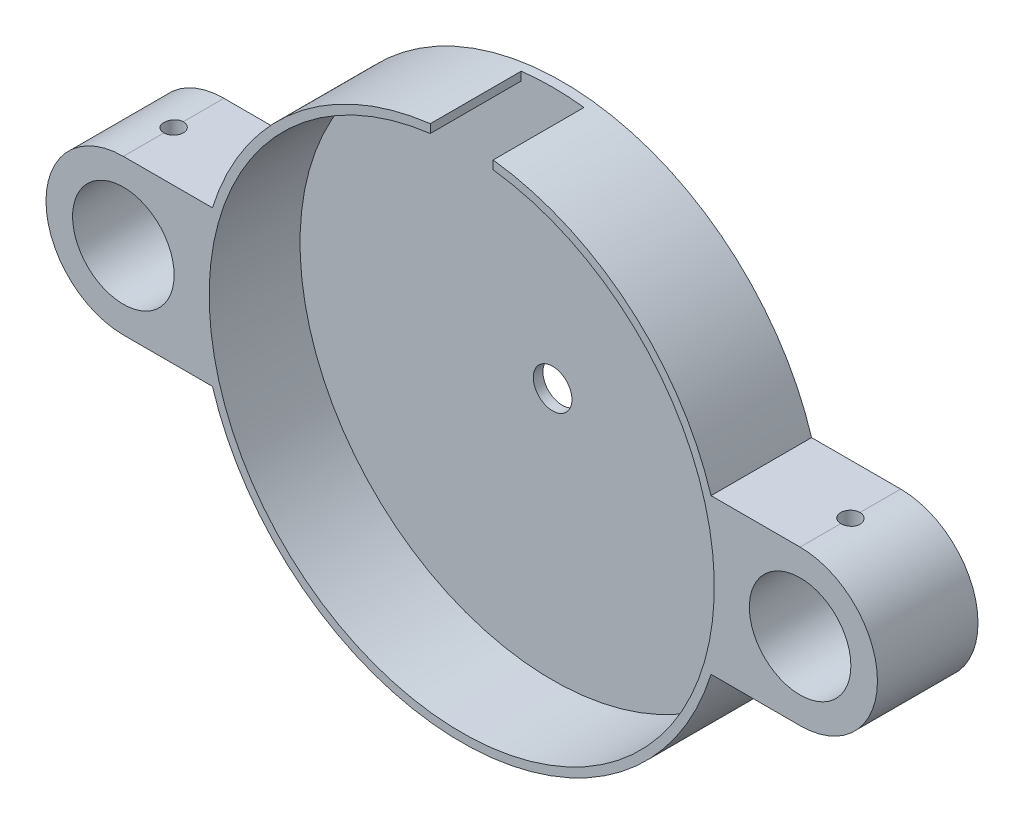
ISO-10303-21;
HEADER;
FILE_DESCRIPTION(('STEP AP214'),'2;1');
FILE_NAME('part.step','',(''),(''),'','','');
FILE_SCHEMA(('AUTOMOTIVE_DESIGN { 1 0 10303 214 1 1 1 1 }'));
ENDSEC;
DATA;
#1=APPLICATION_CONTEXT('core data for automotive mechanical design processes');
#2=APPLICATION_PROTOCOL_DEFINITION('international standard','automotive_design',2000,#1);
#3=PRODUCT_CONTEXT('',#1,'mechanical');
#4=PRODUCT('Part','Part','',(#3));
#5=PRODUCT_RELATED_PRODUCT_CATEGORY('part','',(#4));
#6=PRODUCT_DEFINITION_FORMATION('','',#4);
#7=PRODUCT_DEFINITION_CONTEXT('part definition',#1,'design');
#8=PRODUCT_DEFINITION('design','',#6,#7);
#9=PRODUCT_DEFINITION_SHAPE('','',#8);
#10=(LENGTH_UNIT() NAMED_UNIT(*) SI_UNIT(.MILLI.,.METRE.));
#11=(NAMED_UNIT(*) PLANE_ANGLE_UNIT() SI_UNIT($,.RADIAN.));
#12=(NAMED_UNIT(*) SI_UNIT($,.STERADIAN.) SOLID_ANGLE_UNIT());
#13=UNCERTAINTY_MEASURE_WITH_UNIT(LENGTH_MEASURE(1.E-05),#10,'distance_accuracy_value','');
#14=(GEOMETRIC_REPRESENTATION_CONTEXT(3) GLOBAL_UNCERTAINTY_ASSIGNED_CONTEXT((#13)) GLOBAL_UNIT_ASSIGNED_CONTEXT((#10,
#11,#12)) REPRESENTATION_CONTEXT('',''));
#15=CARTESIAN_POINT('',(0.,0.,0.));
#16=DIRECTION('',(0.,0.,1.));
#17=DIRECTION('',(1.,0.,0.));
#18=AXIS2_PLACEMENT_3D('',#15,#16,#17);
#19=CARTESIAN_POINT('',(-70.,0.,67.8007201300086));
#20=DIRECTION('',(0.,0.,-1.));
#21=DIRECTION('',(-1.,0.,0.));
#22=AXIS2_PLACEMENT_3D('',#19,#20,#21);
#23=CYLINDRICAL_SURFACE('',#22,16.);
#24=CARTESIAN_POINT('',(-70.,16.,8.4));
#25=CARTESIAN_POINT('',(-70.1118728764446,15.9999984391714,8.40000475274858));
#26=CARTESIAN_POINT('',(-70.2238156594422,15.9988142764392,8.40941830333543));
#27=CARTESIAN_POINT('',(-70.4445862416718,15.9942043208909,8.44682220365664));
#28=CARTESIAN_POINT('',(-70.553410664499,15.9907761875314,8.47483195033871));
#29=CARTESIAN_POINT('',(-70.7647164598504,15.9820644883553,8.54859011513127));
#30=CARTESIAN_POINT('',(-70.8672020481169,15.9767821716443,8.59432659344788));
#31=CARTESIAN_POINT('',(-71.0630235799144,15.9649496070248,8.70221382717583));
#32=CARTESIAN_POINT('',(-71.1563610892451,15.9583995766729,8.76436176682457));
#33=CARTESIAN_POINT('',(-71.3317702535451,15.9447225704506,8.90367355987167));
#34=CARTESIAN_POINT('',(-71.4137842919497,15.9375929175393,8.98090970347699));
#35=CARTESIAN_POINT('',(-71.563722234846,15.923581808078,9.14805025882931));
#36=CARTESIAN_POINT('',(-71.6316454211138,15.9167003641942,9.2379553159306));
#37=CARTESIAN_POINT('',(-71.7516881290271,15.9039384449567,9.42825598205253));
#38=CARTESIAN_POINT('',(-71.8037536767529,15.8980614174233,9.52868588925435));
#39=CARTESIAN_POINT('',(-71.8902584612601,15.8880090276615,9.73694964155788));
#40=CARTESIAN_POINT('',(-71.9246983664522,15.8838336009051,9.8447832057176));
#41=CARTESIAN_POINT('',(-71.9747991840198,15.8776827168289,10.0641953564694));
#42=CARTESIAN_POINT('',(-71.9905573717854,15.875695867494,10.1757514061633));
#43=CARTESIAN_POINT('',(-72.0031484396458,15.8741122251423,10.3999410107775));
#44=CARTESIAN_POINT('',(-71.9999820808019,15.8745153360121,10.512574522185));
#45=CARTESIAN_POINT('',(-71.9748937891583,15.877655642958,10.735043861799));
#46=CARTESIAN_POINT('',(-71.9530790103878,15.8803795036826,10.8448919889602));
#47=CARTESIAN_POINT('',(-71.8914803065456,15.887833598061,11.0593560169752));
#48=CARTESIAN_POINT('',(-71.8516960174015,15.8925638723658,11.1639718117712));
#49=CARTESIAN_POINT('',(-71.7551724479293,15.9035129269172,11.3653343992173));
#50=CARTESIAN_POINT('',(-71.6983866029661,15.9097357856916,11.4620586401992));
#51=CARTESIAN_POINT('',(-71.5695051755655,15.9229656914448,11.6446453555306));
#52=CARTESIAN_POINT('',(-71.4974088928646,15.9299727742853,11.7305073327789));
#53=CARTESIAN_POINT('',(-71.339359288603,15.9440408791234,11.8895541685782));
#54=CARTESIAN_POINT('',(-71.253313606272,15.9511019390951,11.9626472734128));
#55=CARTESIAN_POINT('',(-71.0701257352911,15.9644370604468,12.0933671040244));
#56=CARTESIAN_POINT('',(-70.9729835210546,15.970711120012,12.1509937941376));
#57=CARTESIAN_POINT('',(-70.7702893370908,15.9817692177486,12.2491450563711));
#58=CARTESIAN_POINT('',(-70.6647345562702,15.9865527552123,12.289663883105));
#59=CARTESIAN_POINT('',(-70.4482463523449,15.9940862862405,12.3523763948186));
#60=CARTESIAN_POINT('',(-70.3373131813046,15.996836375007,12.3745709377096));
#61=CARTESIAN_POINT('',(-70.1140105311308,15.9999807712861,12.3998859394084));
#62=CARTESIAN_POINT('',(-70.0016555921589,16.0003906891411,12.4031327938913));
#63=CARTESIAN_POINT('',(-69.778003170802,15.9988507040434,12.3907938127552));
#64=CARTESIAN_POINT('',(-69.6667056659483,15.9969008513457,12.3752083781987));
#65=CARTESIAN_POINT('',(-69.4487003938228,15.9908701500535,12.3257522329805));
#66=CARTESIAN_POINT('',(-69.3419787436603,15.986796326511,12.2919417892779));
#67=CARTESIAN_POINT('',(-69.1357202761133,15.9769737848016,12.2070580384697));
#68=CARTESIAN_POINT('',(-69.0361837028278,15.971225009765,12.1559841452069));
#69=CARTESIAN_POINT('',(-68.8465563834501,15.9586545832809,12.037717489994));
#70=CARTESIAN_POINT('',(-68.756516992045,15.9518275523401,11.9704429681555));
#71=CARTESIAN_POINT('',(-68.588962408299,15.9378811386053,11.8218004019726));
#72=CARTESIAN_POINT('',(-68.5114477133305,15.9307617442152,11.7404317981992));
#73=CARTESIAN_POINT('',(-68.3706944329456,15.9169848437007,11.5653540665943));
#74=CARTESIAN_POINT('',(-68.3075396315457,15.9103301977706,11.4715773229517));
#75=CARTESIAN_POINT('',(-68.1978776884452,15.8982832882972,11.2746734041162));
#76=CARTESIAN_POINT('',(-68.1513702130173,15.8928909994482,11.1715464164188));
#77=CARTESIAN_POINT('',(-68.0764587369068,15.883998803144,10.9591397446819));
#78=CARTESIAN_POINT('',(-68.0480074980343,15.8804939614783,10.8498769359616));
#79=CARTESIAN_POINT('',(-68.0098640049057,15.8757593272596,10.6280780129755));
#80=CARTESIAN_POINT('',(-68.0001708779714,15.8745294288702,10.5155420512328));
#81=CARTESIAN_POINT('',(-67.9998347711321,15.8744870158596,10.2912248566363));
#82=CARTESIAN_POINT('',(-68.0090601618406,15.8756577980156,10.1794438013345));
#83=CARTESIAN_POINT('',(-68.0460204761205,15.8802489162976,9.95903429652395));
#84=CARTESIAN_POINT('',(-68.0737554016754,15.8836692526647,9.85040584735297));
#85=CARTESIAN_POINT('',(-68.1469063410483,15.8923689261964,9.63940243458689));
#86=CARTESIAN_POINT('',(-68.1923160152233,15.8976475967423,9.53702524398256));
#87=CARTESIAN_POINT('',(-68.2995144782798,15.9094702659586,9.34132267676137));
#88=CARTESIAN_POINT('',(-68.3613034723923,15.9160142804833,9.24799741358415));
#89=CARTESIAN_POINT('',(-68.4999949349873,15.9296848380179,9.07237501972763));
#90=CARTESIAN_POINT('',(-68.57699549938,15.9368149766723,8.99015563123603));
#91=CARTESIAN_POINT('',(-68.7437198184253,15.9508226527432,8.83975453986563));
#92=CARTESIAN_POINT('',(-68.8334465686867,15.9577001302047,8.77157615138056));
#93=CARTESIAN_POINT('',(-69.0234675033166,15.970456452694,8.65097171431577));
#94=CARTESIAN_POINT('',(-69.1238005763231,15.9763314006264,8.5986065552806));
#95=CARTESIAN_POINT('',(-69.331853678159,15.9863811926138,8.51154300566698));
#96=CARTESIAN_POINT('',(-69.4395655353038,15.9905578829566,8.47682541891724));
#97=CARTESIAN_POINT('',(-69.6231953824257,15.995733762622,8.43435252946296));
#98=CARTESIAN_POINT('',(-69.6979554691865,15.9973258071636,8.42148884641435));
#99=CARTESIAN_POINT('',(-69.8484663494301,15.9994594506335,8.40431100344542));
#100=CARTESIAN_POINT('',(-69.9242171356032,16.0000010573078,8.39999678048056));
#101=CARTESIAN_POINT('',(-70.,16.,8.4));
#102=B_SPLINE_CURVE_WITH_KNOTS('',3,(#24,#25,#26,#27,#28,#29,#30,#31,#32,#33,#34,#35,#36,#37,
#38,#39,#40,#41,#42,#43,#44,#45,#46,#47,#48,#49,#50,#51,#52,#53,#54,#55,#56,#57,#58,#59,#60,#61,
#62,#63,#64,#65,#66,#67,#68,#69,#70,#71,#72,#73,#74,#75,#76,#77,#78,#79,#80,#81,#82,#83,#84,#85,
#86,#87,#88,#89,#90,#91,#92,#93,#94,#95,#96,#97,#98,#99,#100,#101),.UNSPECIFIED.,.T.,.F.,(4,2,2,
2,2,2,2,2,2,2,2,2,2,2,2,2,2,2,2,2,2,2,2,2,2,2,2,2,2,2,2,2,2,2,2,2,2,2,4),(0.,0.335341818221008,
0.671033968754733,1.0065004065454,1.34190932472859,1.67896650561473,2.01604086240007,
2.35425000255094,2.69244631597444,3.02887380229055,3.36528775907729,3.69978157153352,
4.03428216132992,4.36970741028426,4.7051480041091,5.04290782509133,5.38066842490488,
5.71854236585281,6.05640048723023,6.39200223513535,6.7275968360154,7.06208843114714,
7.39659138463156,7.73281922342735,8.06906041100067,8.40721577206055,8.74536435377228,
9.08262459424737,9.41986914408496,9.75477520961769,10.0896813110364,10.4244673976519,
10.7592576792981,11.0962819015346,11.4333855877601,11.7717712242948,12.1097879894722,
12.336950745501,12.5641118264035),.UNSPECIFIED.);
#103=CARTESIAN_POINT('',(-70.,16.,8.4));
#104=VERTEX_POINT('',#103);
#105=CARTESIAN_POINT('',(-70.,16.,12.4));
#106=VERTEX_POINT('',#105);
#107=EDGE_CURVE('E55',#104,#106,#102,.T.);
#108=ORIENTED_EDGE('',*,*,#107,.F.);
#109=DIRECTION('',(0.,0.,-1.));
#110=VECTOR('',#109,1.);
#111=CARTESIAN_POINT('',(-70.,16.,67.8007201300086));
#112=LINE('',#111,#110);
#113=CARTESIAN_POINT('',(-70.,16.,0.));
#114=VERTEX_POINT('',#113);
#115=EDGE_CURVE('E192',#104,#114,#112,.T.);
#116=ORIENTED_EDGE('',*,*,#115,.T.);
#117=CARTESIAN_POINT('',(-70.,0.,0.));
#118=DIRECTION('',(0.,0.,1.));
#119=DIRECTION('',(1.,0.,0.));
#120=AXIS2_PLACEMENT_3D('',#117,#118,#119);
#121=CIRCLE('',#120,16.);
#122=CARTESIAN_POINT('',(-70.,-16.,0.));
#123=VERTEX_POINT('',#122);
#124=EDGE_CURVE('E178',#114,#123,#121,.T.);
#125=ORIENTED_EDGE('',*,*,#124,.T.);
#126=DIRECTION('',(0.,0.,-1.));
#127=VECTOR('',#126,1.);
#128=CARTESIAN_POINT('',(-70.,-16.,67.8007201300086));
#129=LINE('',#128,#127);
#130=CARTESIAN_POINT('',(-70.,-16.,20.8));
#131=VERTEX_POINT('',#130);
#132=EDGE_CURVE('E190',#131,#123,#129,.T.);
#133=ORIENTED_EDGE('',*,*,#132,.F.);
#134=CARTESIAN_POINT('',(-70.,0.,20.8));
#135=DIRECTION('',(0.,0.,1.));
#136=DIRECTION('',(1.,0.,0.));
#137=AXIS2_PLACEMENT_3D('',#134,#135,#136);
#138=CIRCLE('',#137,16.);
#139=CARTESIAN_POINT('',(-70.,16.,20.8));
#140=VERTEX_POINT('',#139);
#141=EDGE_CURVE('E168',#140,#131,#138,.T.);
#142=ORIENTED_EDGE('',*,*,#141,.F.);
#143=EDGE_CURVE('E193',#140,#106,#112,.T.);
#144=ORIENTED_EDGE('',*,*,#143,.T.);
#145=EDGE_LOOP('',(#108,#116,#125,#133,#142,#144));
#146=FACE_BOUND('',#145,.T.);
#147=ADVANCED_FACE('F35',(#146),#23,.T.);
#148=CARTESIAN_POINT('',(-70.,0.,67.8007201300086));
#149=DIRECTION('',(0.,0.,-1.));
#150=DIRECTION('',(-1.,0.,0.));
#151=AXIS2_PLACEMENT_3D('',#148,#149,#150);
#152=CYLINDRICAL_SURFACE('',#151,10.5);
#153=CARTESIAN_POINT('',(-70.,0.,20.8));
#154=DIRECTION('',(0.,0.,1.));
#155=DIRECTION('',(1.,0.,0.));
#156=AXIS2_PLACEMENT_3D('',#153,#154,#155);
#157=CIRCLE('',#156,10.5);
#158=CARTESIAN_POINT('',(-59.5,0.,20.8));
#159=VERTEX_POINT('',#158);
#160=EDGE_CURVE('E169',#159,#159,#157,.T.);
#161=ORIENTED_EDGE('',*,*,#160,.T.);
#162=EDGE_LOOP('',(#161));
#163=FACE_BOUND('',#162,.T.);
#164=CARTESIAN_POINT('',(-70.,0.,0.));
#165=DIRECTION('',(0.,0.,1.));
#166=DIRECTION('',(1.,0.,0.));
#167=AXIS2_PLACEMENT_3D('',#164,#165,#166);
#168=CIRCLE('',#167,10.5);
#169=CARTESIAN_POINT('',(-59.5,0.,0.));
#170=VERTEX_POINT('',#169);
#171=EDGE_CURVE('E184',#170,#170,#168,.T.);
#172=ORIENTED_EDGE('',*,*,#171,.F.);
#173=EDGE_LOOP('',(#172));
#174=FACE_BOUND('',#173,.T.);
#175=CARTESIAN_POINT('',(-70.,10.5,8.4));
#176=CARTESIAN_POINT('',(-70.1112626732068,10.4999979743929,8.40000421621363));
#177=CARTESIAN_POINT('',(-70.2225798350984,10.4982132825978,8.40931591028934));
#178=CARTESIAN_POINT('',(-70.4420750658481,10.4912658417577,8.44629137476167));
#179=CARTESIAN_POINT('',(-70.5502504432403,10.4861002806795,8.47397042244415));
#180=CARTESIAN_POINT('',(-70.7602561823287,10.4729686963989,8.54680050282468));
#181=CARTESIAN_POINT('',(-70.8620922564569,10.4650052387144,8.59193553315135));
#182=CARTESIAN_POINT('',(-71.0567374462999,10.4471465532496,8.69835043699249));
#183=CARTESIAN_POINT('',(-71.1495472467971,10.4372514721844,8.75962908445376));
#184=CARTESIAN_POINT('',(-71.3246595476384,10.4164844504796,8.89739426578835));
#185=CARTESIAN_POINT('',(-71.4068345602883,10.4056029207544,8.97404141937447));
#186=CARTESIAN_POINT('',(-71.5572415094345,10.3841602588096,9.14002242109597));
#187=CARTESIAN_POINT('',(-71.6254724245306,10.3735991501089,9.2293571977834));
#188=CARTESIAN_POINT('',(-71.7465874919159,10.3538997919733,9.41908226920558));
#189=CARTESIAN_POINT('',(-71.7993414175367,10.3447739002785,9.51955709310997));
#190=CARTESIAN_POINT('',(-71.8871712132609,10.3291136064192,9.72814634260273));
#191=CARTESIAN_POINT('',(-71.92224865908,10.3225789732761,9.83626008626301));
#192=CARTESIAN_POINT('',(-71.9733195203297,10.3129377029114,10.0556923427791));
#193=CARTESIAN_POINT('',(-71.9895355846456,10.3097911053349,10.1669572453517));
#194=CARTESIAN_POINT('',(-72.0031145696447,10.307161743861,10.3906696004605));
#195=CARTESIAN_POINT('',(-72.0004792358439,10.307678640748,10.5031169425477));
#196=CARTESIAN_POINT('',(-71.9766106493159,10.3122815009876,10.7243854627453));
#197=CARTESIAN_POINT('',(-71.955631051433,10.3163187841917,10.8332351655737));
#198=CARTESIAN_POINT('',(-71.8960691517838,10.3274310100144,11.0458410804289));
#199=CARTESIAN_POINT('',(-71.8574860803629,10.3345060854497,11.14959706953));
#200=CARTESIAN_POINT('',(-71.7635657672444,10.3509473410172,11.3498098840211));
#201=CARTESIAN_POINT('',(-71.7081265419373,10.3603273986465,11.4462176819518));
#202=CARTESIAN_POINT('',(-71.5821397235649,10.3803126085096,11.6284576581049));
#203=CARTESIAN_POINT('',(-71.5115905497996,10.3909178888643,11.714288728381));
#204=CARTESIAN_POINT('',(-71.3560210788072,10.4123704255534,11.8744039305281));
#205=CARTESIAN_POINT('',(-71.2707839303096,10.4232188107929,11.9484773772791));
#206=CARTESIAN_POINT('',(-71.0889825398817,10.4437767134731,12.0813062387182));
#207=CARTESIAN_POINT('',(-70.9924181773961,10.4534862187906,12.1400614903535));
#208=CARTESIAN_POINT('',(-70.7904803819306,10.4706929218926,12.2406189958384));
#209=CARTESIAN_POINT('',(-70.6850955207478,10.4781871907582,12.2823988323844));
#210=CARTESIAN_POINT('',(-70.4686287401209,10.4900964856593,12.3476038217401));
#211=CARTESIAN_POINT('',(-70.3575474469878,10.4945118494381,12.3710309877975));
#212=CARTESIAN_POINT('',(-70.1346531021664,10.4997193000827,12.3985712036361));
#213=CARTESIAN_POINT('',(-70.022876932053,10.5005655209332,12.4029728435002));
#214=CARTESIAN_POINT('',(-69.800185889193,10.498689066668,12.3931118947015));
#215=CARTESIAN_POINT('',(-69.6892709730054,10.4959665727471,12.3788502536322));
#216=CARTESIAN_POINT('',(-69.4723699119281,10.487292340486,12.3323074736684));
#217=CARTESIAN_POINT('',(-69.3663511881794,10.481366867614,12.3001728379361));
#218=CARTESIAN_POINT('',(-69.1612062863362,10.4669484110117,12.2189551525294));
#219=CARTESIAN_POINT('',(-69.0620805883639,10.4584552486531,12.1698709236771));
#220=CARTESIAN_POINT('',(-68.8723072987732,10.4397084980025,12.0555119948254));
#221=CARTESIAN_POINT('',(-68.7817674937305,10.4294362000209,11.9900615582954));
#222=CARTESIAN_POINT('',(-68.6128525406399,10.4083178834007,11.8450653311663));
#223=CARTESIAN_POINT('',(-68.5344785687825,10.3974718094254,11.7655181792897));
#224=CARTESIAN_POINT('',(-68.3910194223251,10.376248096682,11.5932783505025));
#225=CARTESIAN_POINT('',(-68.3261314712031,10.3658789338459,11.500420185608));
#226=CARTESIAN_POINT('',(-68.2128743549366,10.3469557185905,11.3049524302999));
#227=CARTESIAN_POINT('',(-68.164504564079,10.3384015974216,11.2023432094476));
#228=CARTESIAN_POINT('',(-68.0859340266442,10.3241439661812,10.9907790279234));
#229=CARTESIAN_POINT('',(-68.0556440655268,10.3184264827985,10.8818581855824));
#230=CARTESIAN_POINT('',(-68.0138188877937,10.3104580861843,10.6603537285239));
#231=CARTESIAN_POINT('',(-68.0022814794188,10.3082067678363,10.5477705434226));
#232=CARTESIAN_POINT('',(-67.9983640721639,10.3074466067947,10.3241138107673));
#233=CARTESIAN_POINT('',(-68.0056728504749,10.3088769648064,10.2130458023238));
#234=CARTESIAN_POINT('',(-68.0385576936863,10.3151839360293,9.99375270386313));
#235=CARTESIAN_POINT('',(-68.0641336410553,10.3200605270675,9.88552759555926));
#236=CARTESIAN_POINT('',(-68.1326937314155,10.3326845207864,9.67516695144504));
#237=CARTESIAN_POINT('',(-68.1756431324414,10.3404261915088,9.57301972649356));
#238=CARTESIAN_POINT('',(-68.2776965366131,10.357911918352,9.37733152380696));
#239=CARTESIAN_POINT('',(-68.3368017312942,10.367656122152,9.28379118153405));
#240=CARTESIAN_POINT('',(-68.4705665135245,10.3882370930006,9.10641518234009));
#241=CARTESIAN_POINT('',(-68.545452199097,10.3990884079132,9.02275169132));
#242=CARTESIAN_POINT('',(-68.70818183305,10.4205531347344,8.86907465998553));
#243=CARTESIAN_POINT('',(-68.7960287538822,10.4311664914262,8.79906425936234));
#244=CARTESIAN_POINT('',(-68.9831706223824,10.4510758496987,8.67406848713434));
#245=CARTESIAN_POINT('',(-69.0825647999533,10.4603586261554,8.61922950459286));
#246=CARTESIAN_POINT('',(-69.2893021123409,10.4764315464421,8.52711716159649));
#247=CARTESIAN_POINT('',(-69.3966377424916,10.4832240083557,8.4898274563583));
#248=CARTESIAN_POINT('',(-69.5868933144151,10.49218127144,8.44136262715925));
#249=CARTESIAN_POINT('',(-69.6687075564226,10.4950965973909,8.425878415039));
#250=CARTESIAN_POINT('',(-69.8336710716053,10.4990066930654,8.40519566348294));
#251=CARTESIAN_POINT('',(-69.9168203088865,10.5000015143387,8.39999684796943));
#252=CARTESIAN_POINT('',(-70.,10.5,8.4));
#253=B_SPLINE_CURVE_WITH_KNOTS('',3,(#175,#176,#177,#178,#179,#180,#181,#182,#183,#184,#185,
#186,#187,#188,#189,#190,#191,#192,#193,#194,#195,#196,#197,#198,#199,#200,#201,#202,#203,#204,
#205,#206,#207,#208,#209,#210,#211,#212,#213,#214,#215,#216,#217,#218,#219,#220,#221,#222,#223,
#224,#225,#226,#227,#228,#229,#230,#231,#232,#233,#234,#235,#236,#237,#238,#239,#240,#241,#242,
#243,#244,#245,#246,#247,#248,#249,#250,#251,#252),.UNSPECIFIED.,.T.,.F.,(4,2,2,2,2,2,2,2,2,2,2,
2,2,2,2,2,2,2,2,2,2,2,2,2,2,2,2,2,2,2,2,2,2,2,2,2,2,2,4),(0.,0.333483802430031,
0.667245332623754,1.00070161708276,1.33413258396014,1.67124928303734,2.0083906669481,
2.34829242006152,2.68816386831249,3.02398123137649,3.3597675003563,3.69098283657374,
4.02221265549115,4.35548777386576,4.68879777425771,5.02753295594229,5.36627174310671,
5.70545641749535,6.04460387885446,6.37858849301336,6.71255615038157,7.04382581519729,
7.37511853098563,7.71013402869824,8.04518189550172,8.38482983470164,8.72446490650361,
9.06240989581901,9.40031538398817,9.73267662393087,10.0650357254753,10.3967334632936,
10.728455671356,11.065300358868,11.4022224167316,11.7422902517103,12.082040729505,
12.3313590630718,12.5806707044156),.UNSPECIFIED.);
#254=CARTESIAN_POINT('',(-70.,10.5,8.4));
#255=VERTEX_POINT('',#254);
#256=EDGE_CURVE('E39',#255,#255,#253,.T.);
#257=ORIENTED_EDGE('',*,*,#256,.T.);
#258=EDGE_LOOP('',(#257));
#259=FACE_BOUND('',#258,.T.);
#260=ADVANCED_FACE('F249',(#163,#174,#259),#152,.F.);
#261=CARTESIAN_POINT('',(70.,0.,67.8007201300086));
#262=DIRECTION('',(0.,0.,-1.));
#263=DIRECTION('',(-1.,0.,0.));
#264=AXIS2_PLACEMENT_3D('',#261,#262,#263);
#265=CYLINDRICAL_SURFACE('',#264,10.5);
#266=CARTESIAN_POINT('',(70.,0.,20.8));
#267=DIRECTION('',(0.,0.,1.));
#268=DIRECTION('',(1.,0.,0.));
#269=AXIS2_PLACEMENT_3D('',#266,#267,#268);
#270=CIRCLE('',#269,10.5);
#271=CARTESIAN_POINT('',(80.5,0.,20.8));
#272=VERTEX_POINT('',#271);
#273=EDGE_CURVE('E314',#272,#272,#270,.T.);
#274=ORIENTED_EDGE('',*,*,#273,.T.);
#275=EDGE_LOOP('',(#274));
#276=FACE_BOUND('',#275,.T.);
#277=CARTESIAN_POINT('',(70.,0.,0.));
#278=DIRECTION('',(0.,0.,1.));
#279=DIRECTION('',(1.,0.,0.));
#280=AXIS2_PLACEMENT_3D('',#277,#278,#279);
#281=CIRCLE('',#280,10.5);
#282=CARTESIAN_POINT('',(80.5,0.,0.));
#283=VERTEX_POINT('',#282);
#284=EDGE_CURVE('E305',#283,#283,#281,.T.);
#285=ORIENTED_EDGE('',*,*,#284,.F.);
#286=EDGE_LOOP('',(#285));
#287=FACE_BOUND('',#286,.T.);
#288=CARTESIAN_POINT('',(70.,10.5,8.4));
#289=CARTESIAN_POINT('',(69.8887373267932,10.4999979743929,8.40000421621363));
#290=CARTESIAN_POINT('',(69.7774201649016,10.4982132825978,8.40931591028934));
#291=CARTESIAN_POINT('',(69.5579249341519,10.4912658417576,8.44629137476167));
#292=CARTESIAN_POINT('',(69.4497495567597,10.4861002806795,8.47397042244415));
#293=CARTESIAN_POINT('',(69.2397438176713,10.4729686963989,8.54680050282468));
#294=CARTESIAN_POINT('',(69.1379077435431,10.4650052387144,8.59193553315135));
#295=CARTESIAN_POINT('',(68.9432625537001,10.4471465532496,8.69835043699249));
#296=CARTESIAN_POINT('',(68.8504527532029,10.4372514721844,8.75962908445376));
#297=CARTESIAN_POINT('',(68.6753404523616,10.4164844504796,8.89739426578835));
#298=CARTESIAN_POINT('',(68.5931654397117,10.4056029207544,8.97404141937447));
#299=CARTESIAN_POINT('',(68.4427584905655,10.3841602588095,9.14002242109597));
#300=CARTESIAN_POINT('',(68.3745275754694,10.3735991501089,9.2293571977834));
#301=CARTESIAN_POINT('',(68.2534125080841,10.3538997919733,9.41908226920558));
#302=CARTESIAN_POINT('',(68.2006585824633,10.3447739002785,9.51955709310997));
#303=CARTESIAN_POINT('',(68.1128287867391,10.3291136064192,9.72814634260273));
#304=CARTESIAN_POINT('',(68.07775134092,10.3225789732761,9.83626008626301));
#305=CARTESIAN_POINT('',(68.0266804796704,10.3129377029114,10.0556923427791));
#306=CARTESIAN_POINT('',(68.0104644153544,10.3097911053349,10.1669572453517));
#307=CARTESIAN_POINT('',(67.9968854303553,10.307161743861,10.3906696004605));
#308=CARTESIAN_POINT('',(67.9995207641561,10.307678640748,10.5031169425477));
#309=CARTESIAN_POINT('',(68.0233893506841,10.3122815009875,10.7243854627453));
#310=CARTESIAN_POINT('',(68.044368948567,10.3163187841917,10.8332351655737));
#311=CARTESIAN_POINT('',(68.1039308482162,10.3274310100144,11.0458410804289));
#312=CARTESIAN_POINT('',(68.1425139196371,10.3345060854497,11.14959706953));
#313=CARTESIAN_POINT('',(68.2364342327556,10.3509473410172,11.3498098840211));
#314=CARTESIAN_POINT('',(68.2918734580627,10.3603273986465,11.4462176819518));
#315=CARTESIAN_POINT('',(68.4178602764352,10.3803126085096,11.6284576581049));
#316=CARTESIAN_POINT('',(68.4884094502004,10.3909178888643,11.714288728381));
#317=CARTESIAN_POINT('',(68.6439789211928,10.4123704255534,11.8744039305281));
#318=CARTESIAN_POINT('',(68.7292160696904,10.4232188107929,11.9484773772791));
#319=CARTESIAN_POINT('',(68.9110174601183,10.4437767134731,12.0813062387182));
#320=CARTESIAN_POINT('',(69.007581822604,10.4534862187906,12.1400614903535));
#321=CARTESIAN_POINT('',(69.2095196180694,10.4706929218926,12.2406189958384));
#322=CARTESIAN_POINT('',(69.3149044792522,10.4781871907582,12.2823988323844));
#323=CARTESIAN_POINT('',(69.5313712598791,10.4900964856593,12.3476038217401));
#324=CARTESIAN_POINT('',(69.6424525530122,10.4945118494381,12.3710309877975));
#325=CARTESIAN_POINT('',(69.8653468978336,10.4997193000827,12.3985712036361));
#326=CARTESIAN_POINT('',(69.977123067947,10.5005655209332,12.4029728435002));
#327=CARTESIAN_POINT('',(70.1998141108071,10.498689066668,12.3931118947015));
#328=CARTESIAN_POINT('',(70.3107290269946,10.4959665727471,12.3788502536322));
#329=CARTESIAN_POINT('',(70.5276300880719,10.487292340486,12.3323074736684));
#330=CARTESIAN_POINT('',(70.6336488118207,10.481366867614,12.3001728379361));
#331=CARTESIAN_POINT('',(70.8387937136638,10.4669484110117,12.2189551525294));
#332=CARTESIAN_POINT('',(70.9379194116361,10.4584552486531,12.1698709236771));
#333=CARTESIAN_POINT('',(71.1276927012268,10.4397084980025,12.0555119948254));
#334=CARTESIAN_POINT('',(71.2182325062695,10.4294362000208,11.9900615582954));
#335=CARTESIAN_POINT('',(71.3871474593601,10.4083178834007,11.8450653311663));
#336=CARTESIAN_POINT('',(71.4655214312175,10.3974718094254,11.7655181792897));
#337=CARTESIAN_POINT('',(71.6089805776749,10.376248096682,11.5932783505025));
#338=CARTESIAN_POINT('',(71.6738685287969,10.3658789338459,11.500420185608));
#339=CARTESIAN_POINT('',(71.7871256450635,10.3469557185905,11.3049524302999));
#340=CARTESIAN_POINT('',(71.835495435921,10.3384015974216,11.2023432094476));
#341=CARTESIAN_POINT('',(71.9140659733558,10.3241439661812,10.9907790279234));
#342=CARTESIAN_POINT('',(71.9443559344732,10.3184264827985,10.8818581855824));
#343=CARTESIAN_POINT('',(71.9861811122063,10.3104580861843,10.6603537285239));
#344=CARTESIAN_POINT('',(71.9977185205812,10.3082067678363,10.5477705434226));
#345=CARTESIAN_POINT('',(72.0016359278361,10.3074466067947,10.3241138107673));
#346=CARTESIAN_POINT('',(71.9943271495251,10.3088769648064,10.2130458023238));
#347=CARTESIAN_POINT('',(71.9614423063137,10.3151839360293,9.99375270386313));
#348=CARTESIAN_POINT('',(71.9358663589447,10.3200605270675,9.88552759555926));
#349=CARTESIAN_POINT('',(71.8673062685845,10.3326845207864,9.67516695144504));
#350=CARTESIAN_POINT('',(71.8243568675586,10.3404261915088,9.57301972649356));
#351=CARTESIAN_POINT('',(71.7223034633869,10.357911918352,9.37733152380696));
#352=CARTESIAN_POINT('',(71.6631982687058,10.367656122152,9.28379118153405));
#353=CARTESIAN_POINT('',(71.5294334864755,10.3882370930006,9.1064151823401));
#354=CARTESIAN_POINT('',(71.454547800903,10.3990884079132,9.02275169132001));
#355=CARTESIAN_POINT('',(71.29181816695,10.4205531347344,8.86907465998554));
#356=CARTESIAN_POINT('',(71.2039712461179,10.4311664914262,8.79906425936234));
#357=CARTESIAN_POINT('',(71.0168293776176,10.4510758496987,8.67406848713434));
#358=CARTESIAN_POINT('',(70.9174352000467,10.4603586261554,8.61922950459286));
#359=CARTESIAN_POINT('',(70.7106978876591,10.4764315464421,8.52711716159649));
#360=CARTESIAN_POINT('',(70.6033622575085,10.4832240083557,8.4898274563583));
#361=CARTESIAN_POINT('',(70.4131066855849,10.49218127144,8.44136262715925));
#362=CARTESIAN_POINT('',(70.3312924435774,10.4950965973909,8.425878415039));
#363=CARTESIAN_POINT('',(70.1663289283947,10.4990066930654,8.40519566348294));
#364=CARTESIAN_POINT('',(70.0831796911135,10.5000015143387,8.39999684796943));
#365=CARTESIAN_POINT('',(70.,10.5,8.4));
#366=B_SPLINE_CURVE_WITH_KNOTS('',3,(#288,#289,#290,#291,#292,#293,#294,#295,#296,#297,#298,
#299,#300,#301,#302,#303,#304,#305,#306,#307,#308,#309,#310,#311,#312,#313,#314,#315,#316,#317,
#318,#319,#320,#321,#322,#323,#324,#325,#326,#327,#328,#329,#330,#331,#332,#333,#334,#335,#336,
#337,#338,#339,#340,#341,#342,#343,#344,#345,#346,#347,#348,#349,#350,#351,#352,#353,#354,#355,
#356,#357,#358,#359,#360,#361,#362,#363,#364,#365),.UNSPECIFIED.,.T.,.F.,(4,2,2,2,2,2,2,2,2,2,2,
2,2,2,2,2,2,2,2,2,2,2,2,2,2,2,2,2,2,2,2,2,2,2,2,2,2,2,4),(0.,0.333483802430031,
0.667245332623754,1.00070161708276,1.33413258396014,1.67124928303734,2.0083906669481,
2.34829242006152,2.68816386831249,3.0239812313765,3.3597675003563,3.69098283657374,
4.02221265549115,4.35548777386576,4.68879777425771,5.02753295594227,5.36627174310671,
5.70545641749535,6.04460387885446,6.37858849301336,6.71255615038157,7.04382581519731,
7.37511853098563,7.71013402869825,8.04518189550172,8.38482983470164,8.7244649065036,
9.06240989581901,9.40031538398817,9.73267662393087,10.0650357254753,10.3967334632936,
10.728455671356,11.065300358868,11.4022224167316,11.7422902517103,12.082040729505,
12.3313590630718,12.5806707044156),.UNSPECIFIED.);
#367=CARTESIAN_POINT('',(70.,10.5,8.4));
#368=VERTEX_POINT('',#367);
#369=EDGE_CURVE('E233',#368,#368,#366,.T.);
#370=ORIENTED_EDGE('',*,*,#369,.T.);
#371=EDGE_LOOP('',(#370));
#372=FACE_BOUND('',#371,.T.);
#373=ADVANCED_FACE('F245',(#276,#287,#372),#265,.F.);
#374=CARTESIAN_POINT('',(70.,0.,67.8007201300086));
#375=DIRECTION('',(0.,0.,-1.));
#376=DIRECTION('',(-1.,0.,0.));
#377=AXIS2_PLACEMENT_3D('',#374,#375,#376);
#378=CYLINDRICAL_SURFACE('',#377,16.);
#379=CARTESIAN_POINT('',(70.,16.,12.4));
#380=CARTESIAN_POINT('',(70.0560358884943,16.0000016411315,12.3999998835905));
#381=CARTESIAN_POINT('',(70.1120447217856,15.9997052515841,12.3976435006381));
#382=CARTESIAN_POINT('',(70.2236573929653,15.9985338263921,12.3882446174227));
#383=CARTESIAN_POINT('',(70.2792612613934,15.9976588348481,12.3812024743058));
#384=CARTESIAN_POINT('',(70.444741047454,15.9941964205898,12.3531222798613));
#385=CARTESIAN_POINT('',(70.5535018176986,15.9907714275751,12.3251302286049));
#386=CARTESIAN_POINT('',(70.7647313126387,15.9820648782364,12.25141070558));
#387=CARTESIAN_POINT('',(70.8671979433246,15.9767827079323,12.2056773680505));
#388=CARTESIAN_POINT('',(71.0630097614699,15.964950154846,12.0977920863042));
#389=CARTESIAN_POINT('',(71.1563556803953,15.9583998738899,12.0356414602097));
#390=CARTESIAN_POINT('',(71.3317671499815,15.9447229375635,11.8963299788894));
#391=CARTESIAN_POINT('',(71.4137762020951,15.9375936579951,11.8190982673434));
#392=CARTESIAN_POINT('',(71.5637148229379,15.9235825161612,11.651959050637));
#393=CARTESIAN_POINT('',(71.6316422216065,15.9167006921647,11.5620495953478));
#394=CARTESIAN_POINT('',(71.751690025124,15.9039382555943,11.3717411734706));
#395=CARTESIAN_POINT('',(71.8037568014572,15.8980610686922,11.2713081290661));
#396=CARTESIAN_POINT('',(71.8902604851101,15.8880087781413,11.0630439448927));
#397=CARTESIAN_POINT('',(71.9246991059912,15.8838335090642,10.9552135253485));
#398=CARTESIAN_POINT('',(71.9747988864292,15.8776827544063,10.7358059768328));
#399=CARTESIAN_POINT('',(71.9905569921439,15.8756959153885,10.6242513085021));
#400=CARTESIAN_POINT('',(72.0031485129995,15.8741122157646,10.4000617277058));
#401=CARTESIAN_POINT('',(71.9999822305496,15.8745153169676,10.2874268325308));
#402=CARTESIAN_POINT('',(71.9748937578366,15.8776556471773,10.0649558337754));
#403=CARTESIAN_POINT('',(71.9530788991315,15.8803795187324,9.95510741082851));
#404=CARTESIAN_POINT('',(71.8914800816591,15.8878336236515,9.74064341292322));
#405=CARTESIAN_POINT('',(71.8516958565259,15.8925638867569,9.63602791555972));
#406=CARTESIAN_POINT('',(71.7551714568495,15.9035130432078,9.434663470125));
#407=CARTESIAN_POINT('',(71.6983843148669,15.9097360503917,9.3379372689274));
#408=CARTESIAN_POINT('',(71.5695019989191,15.9229659878732,9.15535099351746));
#409=CARTESIAN_POINT('',(71.4974067714632,15.9299729209101,9.06949095727621));
#410=CARTESIAN_POINT('',(71.3393713923625,15.9440398442485,8.91045758382594));
#411=CARTESIAN_POINT('',(71.2533405910239,15.9510998718698,8.83737431178243));
#412=CARTESIAN_POINT('',(71.0701527352003,15.9644351973235,8.70664983421046));
#413=CARTESIAN_POINT('',(70.9729923948636,15.9707102622559,8.64901320596272));
#414=CARTESIAN_POINT('',(70.7702211724851,15.9817733104923,8.55081923046523));
#415=CARTESIAN_POINT('',(70.6646025931263,15.9865599194542,8.51027765544008));
#416=CARTESIAN_POINT('',(70.4480603603256,15.9940901882939,8.44758996135409));
#417=CARTESIAN_POINT('',(70.3371449540175,15.9968369205422,8.42541617172393));
#418=CARTESIAN_POINT('',(70.1878595925566,15.9989414890505,8.40848398946353));
#419=CARTESIAN_POINT('',(70.1503259654474,15.999338163174,8.40530098131685));
#420=CARTESIAN_POINT('',(70.0752001909164,15.9998671078557,8.40106183298251));
#421=CARTESIAN_POINT('',(70.037608247981,15.9999998218302,8.40000212592193));
#422=CARTESIAN_POINT('',(70.,16.,8.4));
#423=B_SPLINE_CURVE_WITH_KNOTS('',3,(#379,#380,#381,#382,#383,#384,#385,#386,#387,#388,#389,
#390,#391,#392,#393,#394,#395,#396,#397,#398,#399,#400,#401,#402,#403,#404,#405,#406,#407,#408,
#409,#410,#411,#412,#413,#414,#415,#416,#417,#418,#419,#420,#421,#422),.UNSPECIFIED.,.F.,.F.,(4,
2,2,2,2,2,2,2,2,2,2,2,2,2,2,2,2,2,2,2,2,4),(0.,0.168003736422753,0.335994669164648,
0.671334842274143,1.00678598276876,1.34221019851922,1.67925001673993,2.0163417361119,
2.35456090456941,2.69274718987038,3.02917059940753,3.36558863295698,3.70008335483245,
4.03458303519497,4.37001537048771,4.70544887789411,5.04315910658603,5.38096929806772,
5.71909048137049,6.05670136315145,6.16966829884193,6.28244530496055),.UNSPECIFIED.);
#424=CARTESIAN_POINT('',(70.,16.,12.4));
#425=VERTEX_POINT('',#424);
#426=CARTESIAN_POINT('',(70.,16.,8.4));
#427=VERTEX_POINT('',#426);
#428=EDGE_CURVE('E11',#425,#427,#423,.T.);
#429=ORIENTED_EDGE('',*,*,#428,.F.);
#430=DIRECTION('',(0.,0.,-1.));
#431=VECTOR('',#430,1.);
#432=CARTESIAN_POINT('',(70.,16.,67.8007201300086));
#433=LINE('',#432,#431);
#434=CARTESIAN_POINT('',(70.,16.,20.8));
#435=VERTEX_POINT('',#434);
#436=EDGE_CURVE('E148',#435,#425,#433,.T.);
#437=ORIENTED_EDGE('',*,*,#436,.F.);
#438=CARTESIAN_POINT('',(70.,0.,20.8));
#439=DIRECTION('',(0.,0.,1.));
#440=DIRECTION('',(1.,0.,0.));
#441=AXIS2_PLACEMENT_3D('',#438,#439,#440);
#442=CIRCLE('',#441,16.);
#443=CARTESIAN_POINT('',(70.,-16.,20.8));
#444=VERTEX_POINT('',#443);
#445=EDGE_CURVE('E309',#444,#435,#442,.T.);
#446=ORIENTED_EDGE('',*,*,#445,.F.);
#447=DIRECTION('',(0.,0.,-1.));
#448=VECTOR('',#447,1.);
#449=CARTESIAN_POINT('',(70.,-16.,67.8007201300086));
#450=LINE('',#449,#448);
#451=CARTESIAN_POINT('',(70.,-16.,0.));
#452=VERTEX_POINT('',#451);
#453=EDGE_CURVE('E163',#444,#452,#450,.T.);
#454=ORIENTED_EDGE('',*,*,#453,.T.);
#455=CARTESIAN_POINT('',(70.,0.,0.));
#456=DIRECTION('',(0.,0.,1.));
#457=DIRECTION('',(1.,0.,0.));
#458=AXIS2_PLACEMENT_3D('',#455,#456,#457);
#459=CIRCLE('',#458,16.);
#460=CARTESIAN_POINT('',(70.,16.,0.));
#461=VERTEX_POINT('',#460);
#462=EDGE_CURVE('E153',#452,#461,#459,.T.);
#463=ORIENTED_EDGE('',*,*,#462,.T.);
#464=EDGE_CURVE('E145',#427,#461,#433,.T.);
#465=ORIENTED_EDGE('',*,*,#464,.F.);
#466=EDGE_LOOP('',(#429,#437,#446,#454,#463,#465));
#467=FACE_BOUND('',#466,.T.);
#468=ADVANCED_FACE('F151',(#467),#378,.T.);
#469=CARTESIAN_POINT('',(0.,0.,20.8));
#470=DIRECTION('',(0.,0.,-1.));
#471=DIRECTION('',(-1.,0.,0.));
#472=AXIS2_PLACEMENT_3D('',#469,#470,#471);
#473=CYLINDRICAL_SURFACE('',#472,54.);
#474=DIRECTION('',(0.,0.,-1.));
#475=VECTOR('',#474,1.);
#476=CARTESIAN_POINT('',(-6.5,53.6073688964493,20.8));
#477=LINE('',#476,#475);
#478=CARTESIAN_POINT('',(-6.5,53.6073688964493,2.));
#479=VERTEX_POINT('',#478);
#480=CARTESIAN_POINT('',(-6.5,53.6073688964493,20.8));
#481=VERTEX_POINT('',#480);
#482=EDGE_CURVE('E350',#479,#481,#477,.F.);
#483=ORIENTED_EDGE('',*,*,#482,.F.);
#484=CARTESIAN_POINT('',(0.,0.,2.));
#485=DIRECTION('',(0.,0.,-1.));
#486=DIRECTION('',(-1.,0.,0.));
#487=AXIS2_PLACEMENT_3D('',#484,#485,#486);
#488=CIRCLE('',#487,54.);
#489=CARTESIAN_POINT('',(6.5,53.6073688964493,2.));
#490=VERTEX_POINT('',#489);
#491=EDGE_CURVE('E358',#479,#490,#488,.T.);
#492=ORIENTED_EDGE('',*,*,#491,.T.);
#493=DIRECTION('',(0.,0.,-1.));
#494=VECTOR('',#493,1.);
#495=CARTESIAN_POINT('',(6.5,53.6073688964493,20.8));
#496=LINE('',#495,#494);
#497=CARTESIAN_POINT('',(6.5,53.6073688964493,20.8));
#498=VERTEX_POINT('',#497);
#499=EDGE_CURVE('E368',#498,#490,#496,.T.);
#500=ORIENTED_EDGE('',*,*,#499,.F.);
#501=CARTESIAN_POINT('',(0.,0.,20.8));
#502=DIRECTION('',(0.,0.,1.));
#503=DIRECTION('',(1.,0.,0.));
#504=AXIS2_PLACEMENT_3D('',#501,#502,#503);
#505=CIRCLE('',#504,54.);
#506=CARTESIAN_POINT('',(51.5751878329105,16.,20.8));
#507=VERTEX_POINT('',#506);
#508=EDGE_CURVE('E211',#507,#498,#505,.T.);
#509=ORIENTED_EDGE('',*,*,#508,.F.);
#510=DIRECTION('',(0.,0.,-1.));
#511=VECTOR('',#510,1.);
#512=CARTESIAN_POINT('',(51.5751878329105,16.,67.8007201300086));
#513=LINE('',#512,#511);
#514=CARTESIAN_POINT('',(51.5751878329105,16.,0.));
#515=VERTEX_POINT('',#514);
#516=EDGE_CURVE('E321',#507,#515,#513,.T.);
#517=ORIENTED_EDGE('',*,*,#516,.T.);
#518=CARTESIAN_POINT('',(0.,0.,0.));
#519=DIRECTION('',(0.,0.,1.));
#520=DIRECTION('',(1.,0.,0.));
#521=AXIS2_PLACEMENT_3D('',#518,#519,#520);
#522=CIRCLE('',#521,54.);
#523=CARTESIAN_POINT('',(-51.5751878329105,16.,0.));
#524=VERTEX_POINT('',#523);
#525=EDGE_CURVE('E208',#515,#524,#522,.T.);
#526=ORIENTED_EDGE('',*,*,#525,.T.);
#527=DIRECTION('',(0.,0.,-1.));
#528=VECTOR('',#527,1.);
#529=CARTESIAN_POINT('',(-51.5751878329105,16.,67.8007201300086));
#530=LINE('',#529,#528);
#531=CARTESIAN_POINT('',(-51.5751878329105,16.,20.8));
#532=VERTEX_POINT('',#531);
#533=EDGE_CURVE('E196',#532,#524,#530,.T.);
#534=ORIENTED_EDGE('',*,*,#533,.F.);
#535=EDGE_CURVE('E212',#481,#532,#505,.T.);
#536=ORIENTED_EDGE('',*,*,#535,.F.);
#537=EDGE_LOOP('',(#483,#492,#500,#509,#517,#526,#534,#536));
#538=FACE_BOUND('',#537,.T.);
#539=ADVANCED_FACE('F287',(#538),#473,.T.);
#540=CARTESIAN_POINT('',(0.,0.,20.8));
#541=DIRECTION('',(0.,0.,1.));
#542=DIRECTION('',(1.,0.,0.));
#543=AXIS2_PLACEMENT_3D('',#540,#541,#542);
#544=PLANE('',#543);
#545=ORIENTED_EDGE('',*,*,#160,.F.);
#546=EDGE_LOOP('',(#545));
#547=FACE_BOUND('',#546,.T.);
#548=ORIENTED_EDGE('',*,*,#273,.F.);
#549=EDGE_LOOP('',(#548));
#550=FACE_BOUND('',#549,.T.);
#551=CARTESIAN_POINT('',(0.,0.,20.8));
#552=DIRECTION('',(0.,0.,1.));
#553=DIRECTION('',(1.,0.,0.));
#554=AXIS2_PLACEMENT_3D('',#551,#552,#553);
#555=CIRCLE('',#554,52.25);
#556=CARTESIAN_POINT('',(-6.5,51.8441173133462,20.8));
#557=VERTEX_POINT('',#556);
#558=CARTESIAN_POINT('',(6.5,51.8441173133462,20.8));
#559=VERTEX_POINT('',#558);
#560=EDGE_CURVE('E205',#557,#559,#555,.T.);
#561=ORIENTED_EDGE('',*,*,#560,.F.);
#562=DIRECTION('',(0.,-1.,0.));
#563=VECTOR('',#562,1.);
#564=CARTESIAN_POINT('',(-6.5,0.,20.8));
#565=LINE('',#564,#563);
#566=EDGE_CURVE('E352',#481,#557,#565,.T.);
#567=ORIENTED_EDGE('',*,*,#566,.F.);
#568=ORIENTED_EDGE('',*,*,#535,.T.);
#569=DIRECTION('',(1.,0.,0.));
#570=VECTOR('',#569,1.);
#571=CARTESIAN_POINT('',(0.,16.,20.8));
#572=LINE('',#571,#570);
#573=EDGE_CURVE('E172',#140,#532,#572,.T.);
#574=ORIENTED_EDGE('',*,*,#573,.F.);
#575=ORIENTED_EDGE('',*,*,#141,.T.);
#576=DIRECTION('',(1.,0.,0.));
#577=VECTOR('',#576,1.);
#578=CARTESIAN_POINT('',(0.,-16.,20.8));
#579=LINE('',#578,#577);
#580=CARTESIAN_POINT('',(-51.5751878329105,-16.,20.8));
#581=VERTEX_POINT('',#580);
#582=EDGE_CURVE('E165',#131,#581,#579,.T.);
#583=ORIENTED_EDGE('',*,*,#582,.T.);
#584=CARTESIAN_POINT('',(51.5751878329105,-16.,20.8));
#585=VERTEX_POINT('',#584);
#586=EDGE_CURVE('E49',#581,#585,#505,.T.);
#587=ORIENTED_EDGE('',*,*,#586,.T.);
#588=DIRECTION('',(-1.,0.,0.));
#589=VECTOR('',#588,1.);
#590=CARTESIAN_POINT('',(0.,-16.,20.8));
#591=LINE('',#590,#589);
#592=EDGE_CURVE('E318',#444,#585,#591,.T.);
#593=ORIENTED_EDGE('',*,*,#592,.F.);
#594=ORIENTED_EDGE('',*,*,#445,.T.);
#595=DIRECTION('',(-1.,0.,0.));
#596=VECTOR('',#595,1.);
#597=CARTESIAN_POINT('',(0.,16.,20.8));
#598=LINE('',#597,#596);
#599=EDGE_CURVE('E202',#435,#507,#598,.T.);
#600=ORIENTED_EDGE('',*,*,#599,.T.);
#601=ORIENTED_EDGE('',*,*,#508,.T.);
#602=DIRECTION('',(0.,1.,0.));
#603=VECTOR('',#602,1.);
#604=CARTESIAN_POINT('',(6.5,0.,20.8));
#605=LINE('',#604,#603);
#606=EDGE_CURVE('E355',#559,#498,#605,.T.);
#607=ORIENTED_EDGE('',*,*,#606,.F.);
#608=EDGE_LOOP('',(#561,#567,#568,#574,#575,#583,#587,#593,#594,#600,#601,#607));
#609=FACE_BOUND('',#608,.T.);
#610=ADVANCED_FACE('F284',(#547,#550,#609),#544,.T.);
#611=CARTESIAN_POINT('',(0.,0.,168.585317267988));
#612=DIRECTION('',(0.,0.,-1.));
#613=DIRECTION('',(-1.,0.,0.));
#614=AXIS2_PLACEMENT_3D('',#611,#612,#613);
#615=CYLINDRICAL_SURFACE('',#614,52.25);
#616=CARTESIAN_POINT('',(0.,0.,2.));
#617=DIRECTION('',(0.,0.,1.));
#618=DIRECTION('',(1.,0.,0.));
#619=AXIS2_PLACEMENT_3D('',#616,#617,#618);
#620=CIRCLE('',#619,52.25);
#621=CARTESIAN_POINT('',(-6.5,51.8441173133462,2.));
#622=VERTEX_POINT('',#621);
#623=CARTESIAN_POINT('',(6.5,51.8441173133462,2.));
#624=VERTEX_POINT('',#623);
#625=EDGE_CURVE('E199',#622,#624,#620,.T.);
#626=ORIENTED_EDGE('',*,*,#625,.F.);
#627=DIRECTION('',(0.,0.,-1.));
#628=VECTOR('',#627,1.);
#629=CARTESIAN_POINT('',(-6.5,51.8441173133462,168.585317267988));
#630=LINE('',#629,#628);
#631=EDGE_CURVE('E370',#622,#557,#630,.F.);
#632=ORIENTED_EDGE('',*,*,#631,.T.);
#633=ORIENTED_EDGE('',*,*,#560,.T.);
#634=DIRECTION('',(0.,0.,-1.));
#635=VECTOR('',#634,1.);
#636=CARTESIAN_POINT('',(6.5,51.8441173133462,168.585317267988));
#637=LINE('',#636,#635);
#638=EDGE_CURVE('E365',#559,#624,#637,.T.);
#639=ORIENTED_EDGE('',*,*,#638,.T.);
#640=EDGE_LOOP('',(#626,#632,#633,#639));
#641=FACE_BOUND('',#640,.T.);
#642=ADVANCED_FACE('F281',(#641),#615,.F.);
#643=CARTESIAN_POINT('',(-51.5751878329105,-16.,0.));
#644=VERTEX_POINT('',#643);
#645=CARTESIAN_POINT('',(51.5751878329105,-16.,0.));
#646=VERTEX_POINT('',#645);
#647=EDGE_CURVE('E213',#644,#646,#522,.T.);
#648=ORIENTED_EDGE('',*,*,#647,.T.);
#649=DIRECTION('',(0.,0.,-1.));
#650=VECTOR('',#649,1.);
#651=CARTESIAN_POINT('',(51.5751878329105,-16.,67.8007201300086));
#652=LINE('',#651,#650);
#653=EDGE_CURVE('E317',#585,#646,#652,.T.);
#654=ORIENTED_EDGE('',*,*,#653,.F.);
#655=ORIENTED_EDGE('',*,*,#586,.F.);
#656=DIRECTION('',(0.,0.,-1.));
#657=VECTOR('',#656,1.);
#658=CARTESIAN_POINT('',(-51.5751878329105,-16.,67.8007201300086));
#659=LINE('',#658,#657);
#660=EDGE_CURVE('E187',#581,#644,#659,.T.);
#661=ORIENTED_EDGE('',*,*,#660,.T.);
#662=EDGE_LOOP('',(#648,#654,#655,#661));
#663=FACE_BOUND('',#662,.T.);
#664=ADVANCED_FACE('F37',(#663),#473,.T.);
#665=CARTESIAN_POINT('',(0.,0.,0.));
#666=DIRECTION('',(0.,0.,1.));
#667=DIRECTION('',(1.,0.,0.));
#668=AXIS2_PLACEMENT_3D('',#665,#666,#667);
#669=PLANE('',#668);
#670=CARTESIAN_POINT('',(0.,0.,0.));
#671=DIRECTION('',(0.,0.,1.));
#672=DIRECTION('',(1.,0.,0.));
#673=AXIS2_PLACEMENT_3D('',#670,#671,#672);
#674=CIRCLE('',#673,4.);
#675=CARTESIAN_POINT('',(4.,0.,0.));
#676=VERTEX_POINT('',#675);
#677=EDGE_CURVE('E159',#676,#676,#674,.T.);
#678=ORIENTED_EDGE('',*,*,#677,.T.);
#679=EDGE_LOOP('',(#678));
#680=FACE_BOUND('',#679,.T.);
#681=ORIENTED_EDGE('',*,*,#647,.F.);
#682=DIRECTION('',(1.,0.,0.));
#683=VECTOR('',#682,1.);
#684=CARTESIAN_POINT('',(0.,-16.,0.));
#685=LINE('',#684,#683);
#686=EDGE_CURVE('E181',#123,#644,#685,.T.);
#687=ORIENTED_EDGE('',*,*,#686,.F.);
#688=ORIENTED_EDGE('',*,*,#124,.F.);
#689=DIRECTION('',(1.,0.,0.));
#690=VECTOR('',#689,1.);
#691=CARTESIAN_POINT('',(0.,16.,0.));
#692=LINE('',#691,#690);
#693=EDGE_CURVE('E175',#114,#524,#692,.T.);
#694=ORIENTED_EDGE('',*,*,#693,.T.);
#695=ORIENTED_EDGE('',*,*,#525,.F.);
#696=DIRECTION('',(-1.,0.,0.));
#697=VECTOR('',#696,1.);
#698=CARTESIAN_POINT('',(0.,16.,0.));
#699=LINE('',#698,#697);
#700=EDGE_CURVE('E157',#461,#515,#699,.T.);
#701=ORIENTED_EDGE('',*,*,#700,.F.);
#702=ORIENTED_EDGE('',*,*,#462,.F.);
#703=DIRECTION('',(-1.,0.,0.));
#704=VECTOR('',#703,1.);
#705=CARTESIAN_POINT('',(0.,-16.,0.));
#706=LINE('',#705,#704);
#707=EDGE_CURVE('E307',#452,#646,#706,.T.);
#708=ORIENTED_EDGE('',*,*,#707,.T.);
#709=EDGE_LOOP('',(#681,#687,#688,#694,#695,#701,#702,#708));
#710=FACE_BOUND('',#709,.T.);
#711=ORIENTED_EDGE('',*,*,#171,.T.);
#712=EDGE_LOOP('',(#711));
#713=FACE_BOUND('',#712,.T.);
#714=ORIENTED_EDGE('',*,*,#284,.T.);
#715=EDGE_LOOP('',(#714));
#716=FACE_BOUND('',#715,.T.);
#717=ADVANCED_FACE('F279',(#680,#710,#713,#716),#669,.F.);
#718=CARTESIAN_POINT('',(0.,0.,2.));
#719=DIRECTION('',(0.,0.,1.));
#720=DIRECTION('',(1.,0.,0.));
#721=AXIS2_PLACEMENT_3D('',#718,#719,#720);
#722=PLANE('',#721);
#723=ORIENTED_EDGE('',*,*,#625,.T.);
#724=DIRECTION('',(0.,1.,0.));
#725=VECTOR('',#724,1.);
#726=CARTESIAN_POINT('',(6.5,0.,2.));
#727=LINE('',#726,#725);
#728=EDGE_CURVE('E356',#624,#490,#727,.T.);
#729=ORIENTED_EDGE('',*,*,#728,.T.);
#730=ORIENTED_EDGE('',*,*,#491,.F.);
#731=DIRECTION('',(0.,-1.,0.));
#732=VECTOR('',#731,1.);
#733=CARTESIAN_POINT('',(-6.5,0.,2.));
#734=LINE('',#733,#732);
#735=EDGE_CURVE('E361',#479,#622,#734,.T.);
#736=ORIENTED_EDGE('',*,*,#735,.T.);
#737=EDGE_LOOP('',(#723,#729,#730,#736));
#738=FACE_BOUND('',#737,.T.);
#739=CARTESIAN_POINT('',(0.,0.,2.));
#740=DIRECTION('',(0.,0.,1.));
#741=DIRECTION('',(1.,0.,0.));
#742=AXIS2_PLACEMENT_3D('',#739,#740,#741);
#743=CIRCLE('',#742,4.);
#744=CARTESIAN_POINT('',(4.,0.,2.));
#745=VERTEX_POINT('',#744);
#746=EDGE_CURVE('E155',#745,#745,#743,.T.);
#747=ORIENTED_EDGE('',*,*,#746,.F.);
#748=EDGE_LOOP('',(#747));
#749=FACE_BOUND('',#748,.T.);
#750=ADVANCED_FACE('F276',(#738,#749),#722,.T.);
#751=CARTESIAN_POINT('',(0.,-16.,67.8007201300086));
#752=DIRECTION('',(0.,1.,0.));
#753=DIRECTION('',(0.,0.,1.));
#754=AXIS2_PLACEMENT_3D('',#751,#752,#753);
#755=PLANE('',#754);
#756=ORIENTED_EDGE('',*,*,#582,.F.);
#757=ORIENTED_EDGE('',*,*,#132,.T.);
#758=ORIENTED_EDGE('',*,*,#686,.T.);
#759=ORIENTED_EDGE('',*,*,#660,.F.);
#760=EDGE_LOOP('',(#756,#757,#758,#759));
#761=FACE_BOUND('',#760,.T.);
#762=ADVANCED_FACE('F271',(#761),#755,.F.);
#763=CARTESIAN_POINT('',(0.,16.,67.8007201300086));
#764=DIRECTION('',(0.,1.,0.));
#765=DIRECTION('',(0.,0.,1.));
#766=AXIS2_PLACEMENT_3D('',#763,#764,#765);
#767=PLANE('',#766);
#768=ORIENTED_EDGE('',*,*,#115,.F.);
#769=CARTESIAN_POINT('',(-70.,16.,10.4));
#770=DIRECTION('',(0.,1.,0.));
#771=DIRECTION('',(0.,0.,1.));
#772=AXIS2_PLACEMENT_3D('',#769,#770,#771);
#773=CIRCLE('',#772,2.);
#774=EDGE_CURVE('E149',#106,#104,#773,.T.);
#775=ORIENTED_EDGE('',*,*,#774,.F.);
#776=ORIENTED_EDGE('',*,*,#143,.F.);
#777=ORIENTED_EDGE('',*,*,#573,.T.);
#778=ORIENTED_EDGE('',*,*,#533,.T.);
#779=ORIENTED_EDGE('',*,*,#693,.F.);
#780=EDGE_LOOP('',(#768,#775,#776,#777,#778,#779));
#781=FACE_BOUND('',#780,.T.);
#782=ADVANCED_FACE('F272',(#781),#767,.T.);
#783=CARTESIAN_POINT('',(0.,16.,67.8007201300086));
#784=DIRECTION('',(0.,-1.,0.));
#785=DIRECTION('',(0.,0.,-1.));
#786=AXIS2_PLACEMENT_3D('',#783,#784,#785);
#787=PLANE('',#786);
#788=CARTESIAN_POINT('',(70.,16.,10.4));
#789=DIRECTION('',(0.,1.,0.));
#790=DIRECTION('',(0.,0.,1.));
#791=AXIS2_PLACEMENT_3D('',#788,#789,#790);
#792=CIRCLE('',#791,2.);
#793=EDGE_CURVE('E61',#427,#425,#792,.T.);
#794=ORIENTED_EDGE('',*,*,#793,.F.);
#795=ORIENTED_EDGE('',*,*,#464,.T.);
#796=ORIENTED_EDGE('',*,*,#700,.T.);
#797=ORIENTED_EDGE('',*,*,#516,.F.);
#798=ORIENTED_EDGE('',*,*,#599,.F.);
#799=ORIENTED_EDGE('',*,*,#436,.T.);
#800=EDGE_LOOP('',(#794,#795,#796,#797,#798,#799));
#801=FACE_BOUND('',#800,.T.);
#802=ADVANCED_FACE('F143',(#801),#787,.F.);
#803=CARTESIAN_POINT('',(0.,-16.,67.8007201300086));
#804=DIRECTION('',(0.,-1.,0.));
#805=DIRECTION('',(0.,0.,-1.));
#806=AXIS2_PLACEMENT_3D('',#803,#804,#805);
#807=PLANE('',#806);
#808=ORIENTED_EDGE('',*,*,#453,.F.);
#809=ORIENTED_EDGE('',*,*,#592,.T.);
#810=ORIENTED_EDGE('',*,*,#653,.T.);
#811=ORIENTED_EDGE('',*,*,#707,.F.);
#812=EDGE_LOOP('',(#808,#809,#810,#811));
#813=FACE_BOUND('',#812,.T.);
#814=ADVANCED_FACE('F254',(#813),#807,.T.);
#815=CARTESIAN_POINT('',(0.,0.,13.3137084989848));
#816=DIRECTION('',(0.,0.,-1.));
#817=DIRECTION('',(-1.,0.,0.));
#818=AXIS2_PLACEMENT_3D('',#815,#816,#817);
#819=CYLINDRICAL_SURFACE('',#818,4.);
#820=ORIENTED_EDGE('',*,*,#677,.F.);
#821=EDGE_LOOP('',(#820));
#822=FACE_BOUND('',#821,.T.);
#823=ORIENTED_EDGE('',*,*,#746,.T.);
#824=EDGE_LOOP('',(#823));
#825=FACE_BOUND('',#824,.T.);
#826=ADVANCED_FACE('F251',(#822,#825),#819,.F.);
#827=CARTESIAN_POINT('',(-6.5,0.,81.9568463584303));
#828=DIRECTION('',(1.,0.,0.));
#829=DIRECTION('',(0.,0.,-1.));
#830=AXIS2_PLACEMENT_3D('',#827,#828,#829);
#831=PLANE('',#830);
#832=ORIENTED_EDGE('',*,*,#482,.T.);
#833=ORIENTED_EDGE('',*,*,#566,.T.);
#834=ORIENTED_EDGE('',*,*,#631,.F.);
#835=ORIENTED_EDGE('',*,*,#735,.F.);
#836=EDGE_LOOP('',(#832,#833,#834,#835));
#837=FACE_BOUND('',#836,.T.);
#838=ADVANCED_FACE('F253',(#837),#831,.T.);
#839=CARTESIAN_POINT('',(6.5,0.,81.9568463584303));
#840=DIRECTION('',(-1.,0.,0.));
#841=DIRECTION('',(0.,0.,1.));
#842=AXIS2_PLACEMENT_3D('',#839,#840,#841);
#843=PLANE('',#842);
#844=ORIENTED_EDGE('',*,*,#499,.T.);
#845=ORIENTED_EDGE('',*,*,#728,.F.);
#846=ORIENTED_EDGE('',*,*,#638,.F.);
#847=ORIENTED_EDGE('',*,*,#606,.T.);
#848=EDGE_LOOP('',(#844,#845,#846,#847));
#849=FACE_BOUND('',#848,.T.);
#850=ADVANCED_FACE('F227',(#849),#843,.T.);
#851=CARTESIAN_POINT('',(70.,21.6568542494924,10.4));
#852=DIRECTION('',(0.,-1.,0.));
#853=DIRECTION('',(0.,0.,-1.));
#854=AXIS2_PLACEMENT_3D('',#851,#852,#853);
#855=CYLINDRICAL_SURFACE('',#854,2.);
#856=ORIENTED_EDGE('',*,*,#369,.F.);
#857=EDGE_LOOP('',(#856));
#858=FACE_BOUND('',#857,.T.);
#859=ORIENTED_EDGE('',*,*,#428,.T.);
#860=ORIENTED_EDGE('',*,*,#793,.T.);
#861=EDGE_LOOP('',(#859,#860));
#862=FACE_BOUND('',#861,.T.);
#863=ADVANCED_FACE('F138',(#858,#862),#855,.F.);
#864=CARTESIAN_POINT('',(-70.,21.6568542494924,10.4));
#865=DIRECTION('',(0.,-1.,0.));
#866=DIRECTION('',(0.,0.,-1.));
#867=AXIS2_PLACEMENT_3D('',#864,#865,#866);
#868=CYLINDRICAL_SURFACE('',#867,2.);
#869=ORIENTED_EDGE('',*,*,#256,.F.);
#870=EDGE_LOOP('',(#869));
#871=FACE_BOUND('',#870,.T.);
#872=ORIENTED_EDGE('',*,*,#107,.T.);
#873=ORIENTED_EDGE('',*,*,#774,.T.);
#874=EDGE_LOOP('',(#872,#873));
#875=FACE_BOUND('',#874,.T.);
#876=ADVANCED_FACE('F226',(#871,#875),#868,.F.);
#877=CLOSED_SHELL('',(#147,#260,#373,#468,#539,#610,#642,#664,#717,#750,#762,#782,#802,#814,
#826,#838,#850,#863,#876));
#878=MANIFOLD_SOLID_BREP('B2',#877);
#879=ADVANCED_BREP_SHAPE_REPRESENTATION('',(#18,#878),#14);
#880=SHAPE_DEFINITION_REPRESENTATION(#9,#879);
ENDSEC;
END-ISO-10303-21;
